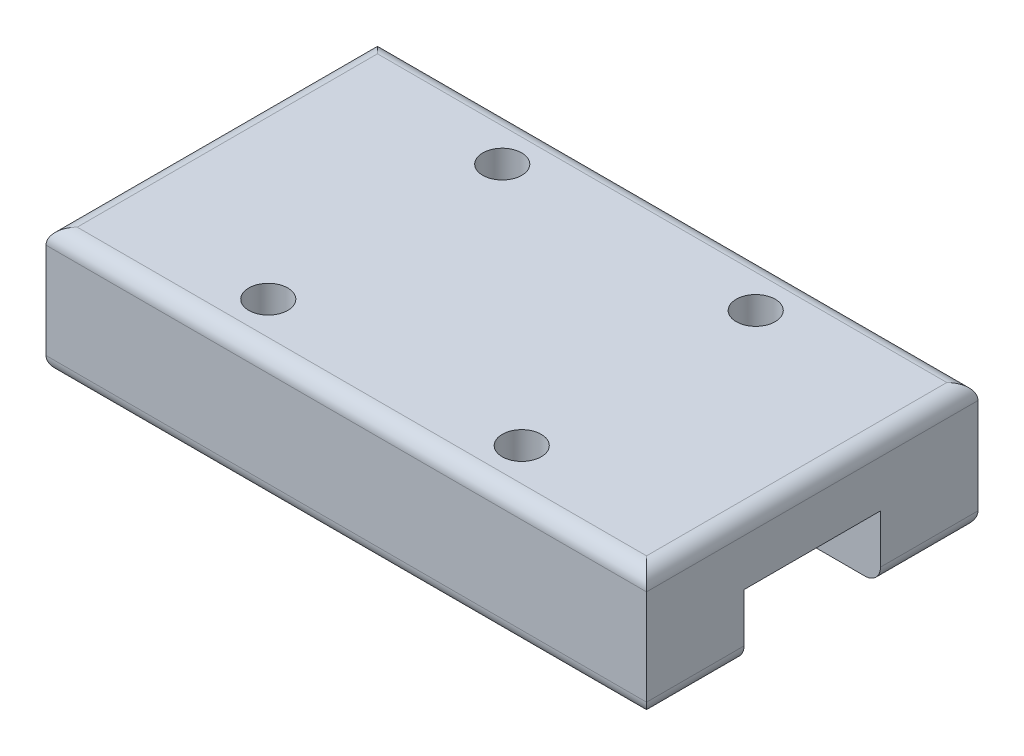
ISO-10303-21;
HEADER;
FILE_DESCRIPTION(('STEP AP214'),'2;1');
FILE_NAME('part.step','',(''),(''),'','','');
FILE_SCHEMA(('AUTOMOTIVE_DESIGN { 1 0 10303 214 1 1 1 1 }'));
ENDSEC;
DATA;
#1=APPLICATION_CONTEXT('core data for automotive mechanical design processes');
#2=APPLICATION_PROTOCOL_DEFINITION('international standard','automotive_design',2000,#1);
#3=PRODUCT_CONTEXT('',#1,'mechanical');
#4=PRODUCT('Part','Part','',(#3));
#5=PRODUCT_RELATED_PRODUCT_CATEGORY('part','',(#4));
#6=PRODUCT_DEFINITION_FORMATION('','',#4);
#7=PRODUCT_DEFINITION_CONTEXT('part definition',#1,'design');
#8=PRODUCT_DEFINITION('design','',#6,#7);
#9=PRODUCT_DEFINITION_SHAPE('','',#8);
#10=(LENGTH_UNIT() NAMED_UNIT(*) SI_UNIT(.MILLI.,.METRE.));
#11=(NAMED_UNIT(*) PLANE_ANGLE_UNIT() SI_UNIT($,.RADIAN.));
#12=(NAMED_UNIT(*) SI_UNIT($,.STERADIAN.) SOLID_ANGLE_UNIT());
#13=UNCERTAINTY_MEASURE_WITH_UNIT(LENGTH_MEASURE(1.E-05),#10,'distance_accuracy_value','');
#14=(GEOMETRIC_REPRESENTATION_CONTEXT(3) GLOBAL_UNCERTAINTY_ASSIGNED_CONTEXT((#13)) GLOBAL_UNIT_ASSIGNED_CONTEXT((#10,
#11,#12)) REPRESENTATION_CONTEXT('',''));
#15=CARTESIAN_POINT('',(0.,0.,0.));
#16=DIRECTION('',(0.,0.,1.));
#17=DIRECTION('',(1.,0.,0.));
#18=AXIS2_PLACEMENT_3D('',#15,#16,#17);
#19=CARTESIAN_POINT('',(-15.4,-3.25,8.5));
#20=DIRECTION('',(0.,1.,0.));
#21=DIRECTION('',(0.,0.,1.));
#22=AXIS2_PLACEMENT_3D('',#19,#20,#21);
#23=PLANE('',#22);
#24=DIRECTION('',(-1.,0.,0.));
#25=VECTOR('',#24,1.);
#26=CARTESIAN_POINT('',(15.401,-3.25,-3.5));
#27=LINE('',#26,#25);
#28=CARTESIAN_POINT('',(14.6,-3.25,-3.5));
#29=VERTEX_POINT('',#28);
#30=CARTESIAN_POINT('',(-14.6,-3.25,-3.5));
#31=VERTEX_POINT('',#30);
#32=EDGE_CURVE('E166',#29,#31,#27,.T.);
#33=ORIENTED_EDGE('',*,*,#32,.T.);
#34=DIRECTION('',(0.,0.,-1.));
#35=VECTOR('',#34,1.);
#36=CARTESIAN_POINT('',(-14.6,-3.25,8.5));
#37=LINE('',#36,#35);
#38=CARTESIAN_POINT('',(-14.6,-3.25,-7.7));
#39=VERTEX_POINT('',#38);
#40=EDGE_CURVE('E228',#31,#39,#37,.T.);
#41=ORIENTED_EDGE('',*,*,#40,.T.);
#42=DIRECTION('',(1.,0.,0.));
#43=VECTOR('',#42,1.);
#44=CARTESIAN_POINT('',(-15.4,-3.25,-7.7));
#45=LINE('',#44,#43);
#46=CARTESIAN_POINT('',(14.6,-3.25,-7.7));
#47=VERTEX_POINT('',#46);
#48=EDGE_CURVE('E226',#39,#47,#45,.T.);
#49=ORIENTED_EDGE('',*,*,#48,.T.);
#50=DIRECTION('',(0.,0.,-1.));
#51=VECTOR('',#50,1.);
#52=CARTESIAN_POINT('',(14.6,-3.25,8.5));
#53=LINE('',#52,#51);
#54=EDGE_CURVE('E224',#47,#29,#53,.F.);
#55=ORIENTED_EDGE('',*,*,#54,.T.);
#56=EDGE_LOOP('',(#33,#41,#49,#55));
#57=FACE_BOUND('',#56,.T.);
#58=ADVANCED_FACE('F32',(#57),#23,.F.);
#59=CARTESIAN_POINT('',(-15.4,3.25,8.5));
#60=DIRECTION('',(1.,0.,0.));
#61=DIRECTION('',(0.,0.,-1.));
#62=AXIS2_PLACEMENT_3D('',#59,#60,#61);
#63=PLANE('',#62);
#64=DIRECTION('',(0.,-1.,0.));
#65=VECTOR('',#64,1.);
#66=CARTESIAN_POINT('',(-15.4,3.25,-8.5));
#67=LINE('',#66,#65);
#68=CARTESIAN_POINT('',(-15.4,2.45,-8.5));
#69=VERTEX_POINT('',#68);
#70=CARTESIAN_POINT('',(-15.4,-2.45,-8.5));
#71=VERTEX_POINT('',#70);
#72=EDGE_CURVE('E195',#69,#71,#67,.T.);
#73=ORIENTED_EDGE('',*,*,#72,.T.);
#74=DIRECTION('',(0.,0.,-1.));
#75=VECTOR('',#74,1.);
#76=CARTESIAN_POINT('',(-15.4,-2.45,8.5));
#77=LINE('',#76,#75);
#78=CARTESIAN_POINT('',(-15.4,-2.45,-3.5));
#79=VERTEX_POINT('',#78);
#80=EDGE_CURVE('E235',#71,#79,#77,.F.);
#81=ORIENTED_EDGE('',*,*,#80,.T.);
#82=DIRECTION('',(0.,-1.,0.));
#83=VECTOR('',#82,1.);
#84=CARTESIAN_POINT('',(-15.4,-3.25,-3.5));
#85=LINE('',#84,#83);
#86=CARTESIAN_POINT('',(-15.4,0.0500000000000001,-3.5));
#87=VERTEX_POINT('',#86);
#88=EDGE_CURVE('E161',#87,#79,#85,.T.);
#89=ORIENTED_EDGE('',*,*,#88,.F.);
#90=DIRECTION('',(0.,0.,-1.));
#91=VECTOR('',#90,1.);
#92=CARTESIAN_POINT('',(-15.4,0.0500000000000001,-3.5));
#93=LINE('',#92,#91);
#94=CARTESIAN_POINT('',(-15.4,0.0500000000000001,3.5));
#95=VERTEX_POINT('',#94);
#96=EDGE_CURVE('E145',#95,#87,#93,.T.);
#97=ORIENTED_EDGE('',*,*,#96,.F.);
#98=DIRECTION('',(0.,1.,0.));
#99=VECTOR('',#98,1.);
#100=CARTESIAN_POINT('',(-15.4,0.0500000000000001,3.5));
#101=LINE('',#100,#99);
#102=CARTESIAN_POINT('',(-15.4,-2.45,3.5));
#103=VERTEX_POINT('',#102);
#104=EDGE_CURVE('E133',#103,#95,#101,.T.);
#105=ORIENTED_EDGE('',*,*,#104,.F.);
#106=DIRECTION('',(0.,0.,-1.));
#107=VECTOR('',#106,1.);
#108=CARTESIAN_POINT('',(-15.4,-2.45,8.5));
#109=LINE('',#108,#107);
#110=CARTESIAN_POINT('',(-15.4,-2.45,8.5));
#111=VERTEX_POINT('',#110);
#112=EDGE_CURVE('E233',#103,#111,#109,.F.);
#113=ORIENTED_EDGE('',*,*,#112,.T.);
#114=DIRECTION('',(0.,-1.,0.));
#115=VECTOR('',#114,1.);
#116=CARTESIAN_POINT('',(-15.4,3.25,8.5));
#117=LINE('',#116,#115);
#118=CARTESIAN_POINT('',(-15.4,2.45,8.5));
#119=VERTEX_POINT('',#118);
#120=EDGE_CURVE('E198',#119,#111,#117,.T.);
#121=ORIENTED_EDGE('',*,*,#120,.F.);
#122=DIRECTION('',(0.,0.,-1.));
#123=VECTOR('',#122,1.);
#124=CARTESIAN_POINT('',(-15.4,2.45,8.5));
#125=LINE('',#124,#123);
#126=EDGE_CURVE('E231',#119,#69,#125,.T.);
#127=ORIENTED_EDGE('',*,*,#126,.T.);
#128=EDGE_LOOP('',(#73,#81,#89,#97,#105,#113,#121,#127));
#129=FACE_BOUND('',#128,.T.);
#130=ADVANCED_FACE('F159',(#129),#63,.F.);
#131=DIRECTION('',(-1.,0.,0.));
#132=VECTOR('',#131,1.);
#133=CARTESIAN_POINT('',(15.401,-3.25,3.5));
#134=LINE('',#133,#132);
#135=CARTESIAN_POINT('',(14.6,-3.25,3.5));
#136=VERTEX_POINT('',#135);
#137=CARTESIAN_POINT('',(-14.6,-3.25,3.5));
#138=VERTEX_POINT('',#137);
#139=EDGE_CURVE('E156',#136,#138,#134,.T.);
#140=ORIENTED_EDGE('',*,*,#139,.F.);
#141=DIRECTION('',(0.,0.,-1.));
#142=VECTOR('',#141,1.);
#143=CARTESIAN_POINT('',(14.6,-3.25,8.5));
#144=LINE('',#143,#142);
#145=CARTESIAN_POINT('',(14.6,-3.25,7.7));
#146=VERTEX_POINT('',#145);
#147=EDGE_CURVE('E222',#136,#146,#144,.F.);
#148=ORIENTED_EDGE('',*,*,#147,.T.);
#149=DIRECTION('',(1.,0.,0.));
#150=VECTOR('',#149,1.);
#151=CARTESIAN_POINT('',(-15.4,-3.25,7.7));
#152=LINE('',#151,#150);
#153=CARTESIAN_POINT('',(-14.6,-3.25,7.7));
#154=VERTEX_POINT('',#153);
#155=EDGE_CURVE('E218',#146,#154,#152,.F.);
#156=ORIENTED_EDGE('',*,*,#155,.T.);
#157=DIRECTION('',(0.,0.,-1.));
#158=VECTOR('',#157,1.);
#159=CARTESIAN_POINT('',(-14.6,-3.25,8.5));
#160=LINE('',#159,#158);
#161=EDGE_CURVE('E220',#154,#138,#160,.T.);
#162=ORIENTED_EDGE('',*,*,#161,.T.);
#163=EDGE_LOOP('',(#140,#148,#156,#162));
#164=FACE_BOUND('',#163,.T.);
#165=ADVANCED_FACE('F326',(#164),#23,.F.);
#166=CARTESIAN_POINT('',(15.4,3.25,8.5));
#167=DIRECTION('',(-1.,0.,0.));
#168=DIRECTION('',(0.,0.,1.));
#169=AXIS2_PLACEMENT_3D('',#166,#167,#168);
#170=PLANE('',#169);
#171=DIRECTION('',(0.,1.,0.));
#172=VECTOR('',#171,1.);
#173=CARTESIAN_POINT('',(15.4,3.25,8.5));
#174=LINE('',#173,#172);
#175=CARTESIAN_POINT('',(15.4,-2.45,8.5));
#176=VERTEX_POINT('',#175);
#177=CARTESIAN_POINT('',(15.4,2.45,8.5));
#178=VERTEX_POINT('',#177);
#179=EDGE_CURVE('E201',#176,#178,#174,.T.);
#180=ORIENTED_EDGE('',*,*,#179,.F.);
#181=DIRECTION('',(0.,0.,-1.));
#182=VECTOR('',#181,1.);
#183=CARTESIAN_POINT('',(15.4,-2.45,8.5));
#184=LINE('',#183,#182);
#185=CARTESIAN_POINT('',(15.4,-2.45,3.5));
#186=VERTEX_POINT('',#185);
#187=EDGE_CURVE('E212',#176,#186,#184,.T.);
#188=ORIENTED_EDGE('',*,*,#187,.T.);
#189=DIRECTION('',(0.,-1.,0.));
#190=VECTOR('',#189,1.);
#191=CARTESIAN_POINT('',(15.4,0.0500000000000001,3.5));
#192=LINE('',#191,#190);
#193=CARTESIAN_POINT('',(15.4,0.0500000000000001,3.5));
#194=VERTEX_POINT('',#193);
#195=EDGE_CURVE('E169',#194,#186,#192,.T.);
#196=ORIENTED_EDGE('',*,*,#195,.F.);
#197=DIRECTION('',(0.,0.,1.));
#198=VECTOR('',#197,1.);
#199=CARTESIAN_POINT('',(15.4,0.0500000000000001,-3.5));
#200=LINE('',#199,#198);
#201=CARTESIAN_POINT('',(15.4,0.0500000000000001,-3.5));
#202=VERTEX_POINT('',#201);
#203=EDGE_CURVE('E154',#202,#194,#200,.T.);
#204=ORIENTED_EDGE('',*,*,#203,.F.);
#205=DIRECTION('',(0.,1.,0.));
#206=VECTOR('',#205,1.);
#207=CARTESIAN_POINT('',(15.4,-3.25,-3.5));
#208=LINE('',#207,#206);
#209=CARTESIAN_POINT('',(15.4,-2.45,-3.5));
#210=VERTEX_POINT('',#209);
#211=EDGE_CURVE('E146',#210,#202,#208,.T.);
#212=ORIENTED_EDGE('',*,*,#211,.F.);
#213=DIRECTION('',(0.,0.,-1.));
#214=VECTOR('',#213,1.);
#215=CARTESIAN_POINT('',(15.4,-2.45,8.5));
#216=LINE('',#215,#214);
#217=CARTESIAN_POINT('',(15.4,-2.45,-8.5));
#218=VERTEX_POINT('',#217);
#219=EDGE_CURVE('E210',#210,#218,#216,.T.);
#220=ORIENTED_EDGE('',*,*,#219,.T.);
#221=DIRECTION('',(0.,1.,0.));
#222=VECTOR('',#221,1.);
#223=CARTESIAN_POINT('',(15.4,3.25,-8.5));
#224=LINE('',#223,#222);
#225=CARTESIAN_POINT('',(15.4,2.45,-8.5));
#226=VERTEX_POINT('',#225);
#227=EDGE_CURVE('E202',#218,#226,#224,.T.);
#228=ORIENTED_EDGE('',*,*,#227,.T.);
#229=DIRECTION('',(0.,0.,-1.));
#230=VECTOR('',#229,1.);
#231=CARTESIAN_POINT('',(15.4,2.45,8.5));
#232=LINE('',#231,#230);
#233=EDGE_CURVE('E205',#226,#178,#232,.F.);
#234=ORIENTED_EDGE('',*,*,#233,.T.);
#235=EDGE_LOOP('',(#180,#188,#196,#204,#212,#220,#228,#234));
#236=FACE_BOUND('',#235,.T.);
#237=ADVANCED_FACE('F296',(#236),#170,.F.);
#238=CARTESIAN_POINT('',(-15.4,3.25,8.5));
#239=DIRECTION('',(0.,-1.,0.));
#240=DIRECTION('',(1.,0.,0.));
#241=AXIS2_PLACEMENT_3D('',#238,#239,#240);
#242=PLANE('',#241);
#243=DIRECTION('',(0.,0.,-1.));
#244=VECTOR('',#243,1.);
#245=CARTESIAN_POINT('',(14.6,3.25,8.5));
#246=LINE('',#245,#244);
#247=CARTESIAN_POINT('',(14.6,3.25,7.7));
#248=VERTEX_POINT('',#247);
#249=CARTESIAN_POINT('',(14.6,3.25,-7.7));
#250=VERTEX_POINT('',#249);
#251=EDGE_CURVE('E41',#248,#250,#246,.T.);
#252=ORIENTED_EDGE('',*,*,#251,.T.);
#253=DIRECTION('',(-1.,0.,0.));
#254=VECTOR('',#253,1.);
#255=CARTESIAN_POINT('',(-15.4,3.25,-7.7));
#256=LINE('',#255,#254);
#257=CARTESIAN_POINT('',(-14.6,3.25,-7.7));
#258=VERTEX_POINT('',#257);
#259=EDGE_CURVE('E11',#250,#258,#256,.T.);
#260=ORIENTED_EDGE('',*,*,#259,.T.);
#261=DIRECTION('',(0.,0.,-1.));
#262=VECTOR('',#261,1.);
#263=CARTESIAN_POINT('',(-14.6,3.25,8.5));
#264=LINE('',#263,#262);
#265=CARTESIAN_POINT('',(-14.6,3.25,7.7));
#266=VERTEX_POINT('',#265);
#267=EDGE_CURVE('E250',#258,#266,#264,.F.);
#268=ORIENTED_EDGE('',*,*,#267,.T.);
#269=DIRECTION('',(-1.,0.,0.));
#270=VECTOR('',#269,1.);
#271=CARTESIAN_POINT('',(15.4,3.25,7.7));
#272=LINE('',#271,#270);
#273=EDGE_CURVE('E52',#266,#248,#272,.F.);
#274=ORIENTED_EDGE('',*,*,#273,.T.);
#275=EDGE_LOOP('',(#252,#260,#268,#274));
#276=FACE_BOUND('',#275,.T.);
#277=CARTESIAN_POINT('',(6.5,3.25,6.));
#278=DIRECTION('',(0.,1.,0.));
#279=DIRECTION('',(-1.,0.,0.));
#280=AXIS2_PLACEMENT_3D('',#277,#278,#279);
#281=CIRCLE('',#280,1.);
#282=CARTESIAN_POINT('',(5.5,3.25,6.));
#283=VERTEX_POINT('',#282);
#284=EDGE_CURVE('E173',#283,#283,#281,.T.);
#285=ORIENTED_EDGE('',*,*,#284,.F.);
#286=EDGE_LOOP('',(#285));
#287=FACE_BOUND('',#286,.T.);
#288=CARTESIAN_POINT('',(6.5,3.25,-6.));
#289=DIRECTION('',(0.,1.,0.));
#290=DIRECTION('',(-1.,0.,0.));
#291=AXIS2_PLACEMENT_3D('',#288,#289,#290);
#292=CIRCLE('',#291,1.);
#293=CARTESIAN_POINT('',(5.5,3.25,-6.));
#294=VERTEX_POINT('',#293);
#295=EDGE_CURVE('E177',#294,#294,#292,.T.);
#296=ORIENTED_EDGE('',*,*,#295,.F.);
#297=EDGE_LOOP('',(#296));
#298=FACE_BOUND('',#297,.T.);
#299=CARTESIAN_POINT('',(-6.5,3.25,6.));
#300=DIRECTION('',(0.,1.,0.));
#301=DIRECTION('',(-1.,0.,0.));
#302=AXIS2_PLACEMENT_3D('',#299,#300,#301);
#303=CIRCLE('',#302,1.);
#304=CARTESIAN_POINT('',(-7.5,3.25,6.));
#305=VERTEX_POINT('',#304);
#306=EDGE_CURVE('E183',#305,#305,#303,.T.);
#307=ORIENTED_EDGE('',*,*,#306,.F.);
#308=EDGE_LOOP('',(#307));
#309=FACE_BOUND('',#308,.T.);
#310=CARTESIAN_POINT('',(-6.5,3.25,-6.));
#311=DIRECTION('',(0.,1.,0.));
#312=DIRECTION('',(-1.,0.,0.));
#313=AXIS2_PLACEMENT_3D('',#310,#311,#312);
#314=CIRCLE('',#313,1.);
#315=CARTESIAN_POINT('',(-7.5,3.25,-6.));
#316=VERTEX_POINT('',#315);
#317=EDGE_CURVE('E189',#316,#316,#314,.T.);
#318=ORIENTED_EDGE('',*,*,#317,.F.);
#319=EDGE_LOOP('',(#318));
#320=FACE_BOUND('',#319,.T.);
#321=ADVANCED_FACE('F348',(#276,#287,#298,#309,#320),#242,.F.);
#322=CARTESIAN_POINT('',(-15.4,-3.25,8.5));
#323=DIRECTION('',(0.,0.,1.));
#324=DIRECTION('',(1.,0.,0.));
#325=AXIS2_PLACEMENT_3D('',#322,#323,#324);
#326=PLANE('',#325);
#327=ORIENTED_EDGE('',*,*,#120,.T.);
#328=DIRECTION('',(1.,0.,0.));
#329=VECTOR('',#328,1.);
#330=CARTESIAN_POINT('',(15.4,-2.45,8.5));
#331=LINE('',#330,#329);
#332=EDGE_CURVE('E248',#111,#176,#331,.T.);
#333=ORIENTED_EDGE('',*,*,#332,.T.);
#334=ORIENTED_EDGE('',*,*,#179,.T.);
#335=DIRECTION('',(-1.,0.,0.));
#336=VECTOR('',#335,1.);
#337=CARTESIAN_POINT('',(-15.4,2.45,8.5));
#338=LINE('',#337,#336);
#339=EDGE_CURVE('E246',#178,#119,#338,.T.);
#340=ORIENTED_EDGE('',*,*,#339,.T.);
#341=EDGE_LOOP('',(#327,#333,#334,#340));
#342=FACE_BOUND('',#341,.T.);
#343=ADVANCED_FACE('F282',(#342),#326,.T.);
#344=CARTESIAN_POINT('',(-15.4,-3.25,-8.5));
#345=DIRECTION('',(0.,0.,1.));
#346=DIRECTION('',(1.,0.,0.));
#347=AXIS2_PLACEMENT_3D('',#344,#345,#346);
#348=PLANE('',#347);
#349=ORIENTED_EDGE('',*,*,#227,.F.);
#350=DIRECTION('',(1.,0.,0.));
#351=VECTOR('',#350,1.);
#352=CARTESIAN_POINT('',(-15.4,-2.45,-8.5));
#353=LINE('',#352,#351);
#354=EDGE_CURVE('E244',#218,#71,#353,.F.);
#355=ORIENTED_EDGE('',*,*,#354,.T.);
#356=ORIENTED_EDGE('',*,*,#72,.F.);
#357=DIRECTION('',(-1.,0.,0.));
#358=VECTOR('',#357,1.);
#359=CARTESIAN_POINT('',(-15.4,2.45,-8.5));
#360=LINE('',#359,#358);
#361=EDGE_CURVE('E241',#69,#226,#360,.F.);
#362=ORIENTED_EDGE('',*,*,#361,.T.);
#363=EDGE_LOOP('',(#349,#355,#356,#362));
#364=FACE_BOUND('',#363,.T.);
#365=ADVANCED_FACE('F302',(#364),#348,.F.);
#366=CARTESIAN_POINT('',(-6.5,0.75,-6.));
#367=DIRECTION('',(0.,1.,0.));
#368=DIRECTION('',(-1.,0.,0.));
#369=AXIS2_PLACEMENT_3D('',#366,#367,#368);
#370=CYLINDRICAL_SURFACE('',#369,1.);
#371=CARTESIAN_POINT('',(-6.5,0.75,-6.));
#372=DIRECTION('',(0.,1.,0.));
#373=DIRECTION('',(-1.,0.,0.));
#374=AXIS2_PLACEMENT_3D('',#371,#372,#373);
#375=CIRCLE('',#374,1.);
#376=CARTESIAN_POINT('',(-7.5,0.75,-6.));
#377=VERTEX_POINT('',#376);
#378=EDGE_CURVE('E192',#377,#377,#375,.T.);
#379=ORIENTED_EDGE('',*,*,#378,.F.);
#380=EDGE_LOOP('',(#379));
#381=FACE_BOUND('',#380,.T.);
#382=ORIENTED_EDGE('',*,*,#317,.T.);
#383=EDGE_LOOP('',(#382));
#384=FACE_BOUND('',#383,.T.);
#385=ADVANCED_FACE('F356',(#381,#384),#370,.F.);
#386=CARTESIAN_POINT('',(-6.5,0.75,-6.));
#387=DIRECTION('',(0.,1.,0.));
#388=DIRECTION('',(-1.,0.,0.));
#389=AXIS2_PLACEMENT_3D('',#386,#387,#388);
#390=PLANE('',#389);
#391=ORIENTED_EDGE('',*,*,#378,.T.);
#392=EDGE_LOOP('',(#391));
#393=FACE_BOUND('',#392,.T.);
#394=ADVANCED_FACE('F361',(#393),#390,.T.);
#395=CARTESIAN_POINT('',(-6.5,0.75,6.));
#396=DIRECTION('',(0.,1.,0.));
#397=DIRECTION('',(-1.,0.,0.));
#398=AXIS2_PLACEMENT_3D('',#395,#396,#397);
#399=CYLINDRICAL_SURFACE('',#398,1.);
#400=CARTESIAN_POINT('',(-6.5,0.75,6.));
#401=DIRECTION('',(0.,1.,0.));
#402=DIRECTION('',(-1.,0.,0.));
#403=AXIS2_PLACEMENT_3D('',#400,#401,#402);
#404=CIRCLE('',#403,1.);
#405=CARTESIAN_POINT('',(-7.5,0.75,6.));
#406=VERTEX_POINT('',#405);
#407=EDGE_CURVE('E186',#406,#406,#404,.T.);
#408=ORIENTED_EDGE('',*,*,#407,.F.);
#409=EDGE_LOOP('',(#408));
#410=FACE_BOUND('',#409,.T.);
#411=ORIENTED_EDGE('',*,*,#306,.T.);
#412=EDGE_LOOP('',(#411));
#413=FACE_BOUND('',#412,.T.);
#414=ADVANCED_FACE('F365',(#410,#413),#399,.F.);
#415=CARTESIAN_POINT('',(-6.5,0.75,6.));
#416=DIRECTION('',(0.,1.,0.));
#417=DIRECTION('',(-1.,0.,0.));
#418=AXIS2_PLACEMENT_3D('',#415,#416,#417);
#419=PLANE('',#418);
#420=ORIENTED_EDGE('',*,*,#407,.T.);
#421=EDGE_LOOP('',(#420));
#422=FACE_BOUND('',#421,.T.);
#423=ADVANCED_FACE('F369',(#422),#419,.T.);
#424=CARTESIAN_POINT('',(6.5,0.75,-6.));
#425=DIRECTION('',(0.,1.,0.));
#426=DIRECTION('',(-1.,0.,0.));
#427=AXIS2_PLACEMENT_3D('',#424,#425,#426);
#428=CYLINDRICAL_SURFACE('',#427,1.);
#429=CARTESIAN_POINT('',(6.5,0.75,-6.));
#430=DIRECTION('',(0.,1.,0.));
#431=DIRECTION('',(-1.,0.,0.));
#432=AXIS2_PLACEMENT_3D('',#429,#430,#431);
#433=CIRCLE('',#432,1.);
#434=CARTESIAN_POINT('',(5.5,0.75,-6.));
#435=VERTEX_POINT('',#434);
#436=EDGE_CURVE('E180',#435,#435,#433,.T.);
#437=ORIENTED_EDGE('',*,*,#436,.F.);
#438=EDGE_LOOP('',(#437));
#439=FACE_BOUND('',#438,.T.);
#440=ORIENTED_EDGE('',*,*,#295,.T.);
#441=EDGE_LOOP('',(#440));
#442=FACE_BOUND('',#441,.T.);
#443=ADVANCED_FACE('F373',(#439,#442),#428,.F.);
#444=CARTESIAN_POINT('',(6.5,0.75,-6.));
#445=DIRECTION('',(0.,1.,0.));
#446=DIRECTION('',(-1.,0.,0.));
#447=AXIS2_PLACEMENT_3D('',#444,#445,#446);
#448=PLANE('',#447);
#449=ORIENTED_EDGE('',*,*,#436,.T.);
#450=EDGE_LOOP('',(#449));
#451=FACE_BOUND('',#450,.T.);
#452=ADVANCED_FACE('F377',(#451),#448,.T.);
#453=CARTESIAN_POINT('',(6.5,0.75,6.));
#454=DIRECTION('',(0.,1.,0.));
#455=DIRECTION('',(-1.,0.,0.));
#456=AXIS2_PLACEMENT_3D('',#453,#454,#455);
#457=CYLINDRICAL_SURFACE('',#456,1.);
#458=CARTESIAN_POINT('',(6.5,0.75,6.));
#459=DIRECTION('',(0.,1.,0.));
#460=DIRECTION('',(-1.,0.,0.));
#461=AXIS2_PLACEMENT_3D('',#458,#459,#460);
#462=CIRCLE('',#461,1.);
#463=CARTESIAN_POINT('',(5.5,0.75,6.));
#464=VERTEX_POINT('',#463);
#465=EDGE_CURVE('E174',#464,#464,#462,.T.);
#466=ORIENTED_EDGE('',*,*,#465,.F.);
#467=EDGE_LOOP('',(#466));
#468=FACE_BOUND('',#467,.T.);
#469=ORIENTED_EDGE('',*,*,#284,.T.);
#470=EDGE_LOOP('',(#469));
#471=FACE_BOUND('',#470,.T.);
#472=ADVANCED_FACE('F381',(#468,#471),#457,.F.);
#473=CARTESIAN_POINT('',(6.5,0.75,6.));
#474=DIRECTION('',(0.,1.,0.));
#475=DIRECTION('',(-1.,0.,0.));
#476=AXIS2_PLACEMENT_3D('',#473,#474,#475);
#477=PLANE('',#476);
#478=ORIENTED_EDGE('',*,*,#465,.T.);
#479=EDGE_LOOP('',(#478));
#480=FACE_BOUND('',#479,.T.);
#481=ADVANCED_FACE('F385',(#480),#477,.T.);
#482=CARTESIAN_POINT('',(15.401,-3.25,-3.5));
#483=DIRECTION('',(0.,0.,-1.));
#484=DIRECTION('',(-1.,0.,0.));
#485=AXIS2_PLACEMENT_3D('',#482,#483,#484);
#486=PLANE('',#485);
#487=ORIENTED_EDGE('',*,*,#88,.T.);
#488=CARTESIAN_POINT('',(-14.6,-2.45,-3.5));
#489=DIRECTION('',(0.,0.,-1.));
#490=DIRECTION('',(-1.,0.,0.));
#491=AXIS2_PLACEMENT_3D('',#488,#489,#490);
#492=CIRCLE('',#491,0.8);
#493=EDGE_CURVE('E239',#79,#31,#492,.F.);
#494=ORIENTED_EDGE('',*,*,#493,.T.);
#495=ORIENTED_EDGE('',*,*,#32,.F.);
#496=CARTESIAN_POINT('',(14.6,-2.45,-3.5));
#497=DIRECTION('',(0.,0.,-1.));
#498=DIRECTION('',(-1.,0.,0.));
#499=AXIS2_PLACEMENT_3D('',#496,#497,#498);
#500=CIRCLE('',#499,0.8);
#501=EDGE_CURVE('E237',#29,#210,#500,.F.);
#502=ORIENTED_EDGE('',*,*,#501,.T.);
#503=ORIENTED_EDGE('',*,*,#211,.T.);
#504=DIRECTION('',(-1.,0.,0.));
#505=VECTOR('',#504,1.);
#506=CARTESIAN_POINT('',(15.401,0.0500000000000001,-3.5));
#507=LINE('',#506,#505);
#508=EDGE_CURVE('E155',#202,#87,#507,.T.);
#509=ORIENTED_EDGE('',*,*,#508,.T.);
#510=EDGE_LOOP('',(#487,#494,#495,#502,#503,#509));
#511=FACE_BOUND('',#510,.T.);
#512=ADVANCED_FACE('F319',(#511),#486,.F.);
#513=CARTESIAN_POINT('',(15.401,0.0500000000000001,-3.5));
#514=DIRECTION('',(0.,1.,0.));
#515=DIRECTION('',(0.,0.,1.));
#516=AXIS2_PLACEMENT_3D('',#513,#514,#515);
#517=PLANE('',#516);
#518=ORIENTED_EDGE('',*,*,#203,.T.);
#519=DIRECTION('',(-1.,0.,0.));
#520=VECTOR('',#519,1.);
#521=CARTESIAN_POINT('',(15.401,0.0500000000000001,3.5));
#522=LINE('',#521,#520);
#523=EDGE_CURVE('E137',#194,#95,#522,.T.);
#524=ORIENTED_EDGE('',*,*,#523,.T.);
#525=ORIENTED_EDGE('',*,*,#96,.T.);
#526=ORIENTED_EDGE('',*,*,#508,.F.);
#527=EDGE_LOOP('',(#518,#524,#525,#526));
#528=FACE_BOUND('',#527,.T.);
#529=ADVANCED_FACE('F150',(#528),#517,.F.);
#530=CARTESIAN_POINT('',(15.401,0.0500000000000001,3.5));
#531=DIRECTION('',(0.,0.,1.));
#532=DIRECTION('',(1.,0.,0.));
#533=AXIS2_PLACEMENT_3D('',#530,#531,#532);
#534=PLANE('',#533);
#535=ORIENTED_EDGE('',*,*,#195,.T.);
#536=CARTESIAN_POINT('',(14.6,-2.45,3.5));
#537=DIRECTION('',(0.,0.,1.));
#538=DIRECTION('',(1.,0.,0.));
#539=AXIS2_PLACEMENT_3D('',#536,#537,#538);
#540=CIRCLE('',#539,0.8);
#541=EDGE_CURVE('E216',#186,#136,#540,.F.);
#542=ORIENTED_EDGE('',*,*,#541,.T.);
#543=ORIENTED_EDGE('',*,*,#139,.T.);
#544=CARTESIAN_POINT('',(-14.6,-2.45,3.5));
#545=DIRECTION('',(0.,0.,1.));
#546=DIRECTION('',(1.,0.,0.));
#547=AXIS2_PLACEMENT_3D('',#544,#545,#546);
#548=CIRCLE('',#547,0.8);
#549=EDGE_CURVE('E141',#138,#103,#548,.F.);
#550=ORIENTED_EDGE('',*,*,#549,.T.);
#551=ORIENTED_EDGE('',*,*,#104,.T.);
#552=ORIENTED_EDGE('',*,*,#523,.F.);
#553=EDGE_LOOP('',(#535,#542,#543,#550,#551,#552));
#554=FACE_BOUND('',#553,.T.);
#555=ADVANCED_FACE('F136',(#554),#534,.F.);
#556=CARTESIAN_POINT('',(-14.6,-2.45,8.5));
#557=DIRECTION('',(0.,0.,-1.));
#558=DIRECTION('',(-1.,0.,0.));
#559=AXIS2_PLACEMENT_3D('',#556,#557,#558);
#560=CYLINDRICAL_SURFACE('',#559,0.8);
#561=ORIENTED_EDGE('',*,*,#549,.F.);
#562=ORIENTED_EDGE('',*,*,#161,.F.);
#563=CARTESIAN_POINT('',(-14.6,-2.45,7.7));
#564=DIRECTION('',(-0.707106781186547,0.,-0.707106781186547));
#565=DIRECTION('',(-0.707106781186547,0.,0.707106781186547));
#566=AXIS2_PLACEMENT_3D('',#563,#564,#565);
#567=ELLIPSE('',#566,1.13137084989848,0.8);
#568=EDGE_CURVE('E257',#111,#154,#567,.F.);
#569=ORIENTED_EDGE('',*,*,#568,.F.);
#570=ORIENTED_EDGE('',*,*,#112,.F.);
#571=EDGE_LOOP('',(#561,#562,#569,#570));
#572=FACE_BOUND('',#571,.T.);
#573=ADVANCED_FACE('F287',(#572),#560,.T.);
#574=CARTESIAN_POINT('',(-15.4,-2.45,7.7));
#575=DIRECTION('',(-1.,0.,0.));
#576=DIRECTION('',(0.,0.,1.));
#577=AXIS2_PLACEMENT_3D('',#574,#575,#576);
#578=CYLINDRICAL_SURFACE('',#577,0.8);
#579=ORIENTED_EDGE('',*,*,#568,.T.);
#580=ORIENTED_EDGE('',*,*,#155,.F.);
#581=CARTESIAN_POINT('',(14.6,-2.45,7.7));
#582=DIRECTION('',(-0.707106781186547,0.,0.707106781186547));
#583=DIRECTION('',(-0.707106781186547,0.,-0.707106781186547));
#584=AXIS2_PLACEMENT_3D('',#581,#582,#583);
#585=ELLIPSE('',#584,1.13137084989848,0.8);
#586=EDGE_CURVE('E254',#176,#146,#585,.F.);
#587=ORIENTED_EDGE('',*,*,#586,.F.);
#588=ORIENTED_EDGE('',*,*,#332,.F.);
#589=EDGE_LOOP('',(#579,#580,#587,#588));
#590=FACE_BOUND('',#589,.T.);
#591=ADVANCED_FACE('F293',(#590),#578,.T.);
#592=CARTESIAN_POINT('',(14.6,-2.45,8.5));
#593=DIRECTION('',(0.,0.,-1.));
#594=DIRECTION('',(-1.,0.,0.));
#595=AXIS2_PLACEMENT_3D('',#592,#593,#594);
#596=CYLINDRICAL_SURFACE('',#595,0.8);
#597=ORIENTED_EDGE('',*,*,#586,.T.);
#598=ORIENTED_EDGE('',*,*,#147,.F.);
#599=ORIENTED_EDGE('',*,*,#541,.F.);
#600=ORIENTED_EDGE('',*,*,#187,.F.);
#601=EDGE_LOOP('',(#597,#598,#599,#600));
#602=FACE_BOUND('',#601,.T.);
#603=ADVANCED_FACE('F327',(#602),#596,.T.);
#604=CARTESIAN_POINT('',(14.6,-2.45,8.5));
#605=DIRECTION('',(0.,0.,-1.));
#606=DIRECTION('',(-1.,0.,0.));
#607=AXIS2_PLACEMENT_3D('',#604,#605,#606);
#608=CYLINDRICAL_SURFACE('',#607,0.8);
#609=ORIENTED_EDGE('',*,*,#501,.F.);
#610=ORIENTED_EDGE('',*,*,#54,.F.);
#611=CARTESIAN_POINT('',(14.6,-2.45,-7.7));
#612=DIRECTION('',(-0.707106781186547,0.,-0.707106781186547));
#613=DIRECTION('',(0.707106781186547,0.,-0.707106781186547));
#614=AXIS2_PLACEMENT_3D('',#611,#612,#613);
#615=ELLIPSE('',#614,1.13137084989848,0.8);
#616=EDGE_CURVE('E258',#218,#47,#615,.T.);
#617=ORIENTED_EDGE('',*,*,#616,.F.);
#618=ORIENTED_EDGE('',*,*,#219,.F.);
#619=EDGE_LOOP('',(#609,#610,#617,#618));
#620=FACE_BOUND('',#619,.T.);
#621=ADVANCED_FACE('F308',(#620),#608,.T.);
#622=CARTESIAN_POINT('',(-15.4,-2.45,-7.7));
#623=DIRECTION('',(1.,0.,0.));
#624=DIRECTION('',(0.,0.,-1.));
#625=AXIS2_PLACEMENT_3D('',#622,#623,#624);
#626=CYLINDRICAL_SURFACE('',#625,0.8);
#627=ORIENTED_EDGE('',*,*,#616,.T.);
#628=ORIENTED_EDGE('',*,*,#48,.F.);
#629=CARTESIAN_POINT('',(-14.6,-2.45,-7.7));
#630=DIRECTION('',(0.707106781186547,0.,-0.707106781186547));
#631=DIRECTION('',(0.707106781186547,0.,0.707106781186547));
#632=AXIS2_PLACEMENT_3D('',#629,#630,#631);
#633=ELLIPSE('',#632,1.13137084989848,0.8);
#634=EDGE_CURVE('E261',#71,#39,#633,.F.);
#635=ORIENTED_EDGE('',*,*,#634,.F.);
#636=ORIENTED_EDGE('',*,*,#354,.F.);
#637=EDGE_LOOP('',(#627,#628,#635,#636));
#638=FACE_BOUND('',#637,.T.);
#639=ADVANCED_FACE('F312',(#638),#626,.T.);
#640=CARTESIAN_POINT('',(-14.6,-2.45,8.5));
#641=DIRECTION('',(0.,0.,-1.));
#642=DIRECTION('',(-1.,0.,0.));
#643=AXIS2_PLACEMENT_3D('',#640,#641,#642);
#644=CYLINDRICAL_SURFACE('',#643,0.8);
#645=ORIENTED_EDGE('',*,*,#493,.F.);
#646=ORIENTED_EDGE('',*,*,#80,.F.);
#647=ORIENTED_EDGE('',*,*,#634,.T.);
#648=ORIENTED_EDGE('',*,*,#40,.F.);
#649=EDGE_LOOP('',(#645,#646,#647,#648));
#650=FACE_BOUND('',#649,.T.);
#651=ADVANCED_FACE('F317',(#650),#644,.T.);
#652=CARTESIAN_POINT('',(-15.4,2.45,7.7));
#653=DIRECTION('',(1.,0.,0.));
#654=DIRECTION('',(0.,1.,0.));
#655=AXIS2_PLACEMENT_3D('',#652,#653,#654);
#656=CYLINDRICAL_SURFACE('',#655,0.8);
#657=CARTESIAN_POINT('',(-14.6,2.45,7.7));
#658=DIRECTION('',(-0.707106781186547,0.,-0.707106781186547));
#659=DIRECTION('',(0.707106781186547,0.,-0.707106781186547));
#660=AXIS2_PLACEMENT_3D('',#657,#658,#659);
#661=ELLIPSE('',#660,1.13137084989848,0.8);
#662=EDGE_CURVE('E268',#119,#266,#661,.T.);
#663=ORIENTED_EDGE('',*,*,#662,.F.);
#664=ORIENTED_EDGE('',*,*,#339,.F.);
#665=CARTESIAN_POINT('',(14.6,2.45,7.7));
#666=DIRECTION('',(0.707106781186547,0.,-0.707106781186547));
#667=DIRECTION('',(0.707106781186547,0.,0.707106781186547));
#668=AXIS2_PLACEMENT_3D('',#665,#666,#667);
#669=ELLIPSE('',#668,1.13137084989848,0.8);
#670=EDGE_CURVE('E36',#248,#178,#669,.T.);
#671=ORIENTED_EDGE('',*,*,#670,.F.);
#672=ORIENTED_EDGE('',*,*,#273,.F.);
#673=EDGE_LOOP('',(#663,#664,#671,#672));
#674=FACE_BOUND('',#673,.T.);
#675=ADVANCED_FACE('F34',(#674),#656,.T.);
#676=CARTESIAN_POINT('',(14.6,2.45,8.5));
#677=DIRECTION('',(0.,0.,-1.));
#678=DIRECTION('',(-1.,0.,0.));
#679=AXIS2_PLACEMENT_3D('',#676,#677,#678);
#680=CYLINDRICAL_SURFACE('',#679,0.8);
#681=ORIENTED_EDGE('',*,*,#670,.T.);
#682=ORIENTED_EDGE('',*,*,#233,.F.);
#683=CARTESIAN_POINT('',(14.6,2.45,-7.7));
#684=DIRECTION('',(-0.707106781186547,0.,-0.707106781186547));
#685=DIRECTION('',(0.707106781186547,0.,-0.707106781186547));
#686=AXIS2_PLACEMENT_3D('',#683,#684,#685);
#687=ELLIPSE('',#686,1.13137084989848,0.8);
#688=EDGE_CURVE('E267',#250,#226,#687,.T.);
#689=ORIENTED_EDGE('',*,*,#688,.F.);
#690=ORIENTED_EDGE('',*,*,#251,.F.);
#691=EDGE_LOOP('',(#681,#682,#689,#690));
#692=FACE_BOUND('',#691,.T.);
#693=ADVANCED_FACE('F277',(#692),#680,.T.);
#694=CARTESIAN_POINT('',(-14.6,2.45,8.5));
#695=DIRECTION('',(0.,0.,-1.));
#696=DIRECTION('',(-1.,0.,0.));
#697=AXIS2_PLACEMENT_3D('',#694,#695,#696);
#698=CYLINDRICAL_SURFACE('',#697,0.8);
#699=ORIENTED_EDGE('',*,*,#662,.T.);
#700=ORIENTED_EDGE('',*,*,#267,.F.);
#701=CARTESIAN_POINT('',(-14.6,2.45,-7.7));
#702=DIRECTION('',(0.707106781186547,0.,-0.707106781186547));
#703=DIRECTION('',(-0.707106781186547,0.,-0.707106781186547));
#704=AXIS2_PLACEMENT_3D('',#701,#702,#703);
#705=ELLIPSE('',#704,1.13137084989848,0.8);
#706=EDGE_CURVE('E265',#69,#258,#705,.T.);
#707=ORIENTED_EDGE('',*,*,#706,.F.);
#708=ORIENTED_EDGE('',*,*,#126,.F.);
#709=EDGE_LOOP('',(#699,#700,#707,#708));
#710=FACE_BOUND('',#709,.T.);
#711=ADVANCED_FACE('F460',(#710),#698,.T.);
#712=CARTESIAN_POINT('',(-15.4,2.45,-7.7));
#713=DIRECTION('',(-1.,0.,0.));
#714=DIRECTION('',(0.,-1.,0.));
#715=AXIS2_PLACEMENT_3D('',#712,#713,#714);
#716=CYLINDRICAL_SURFACE('',#715,0.8);
#717=ORIENTED_EDGE('',*,*,#688,.T.);
#718=ORIENTED_EDGE('',*,*,#361,.F.);
#719=ORIENTED_EDGE('',*,*,#706,.T.);
#720=ORIENTED_EDGE('',*,*,#259,.F.);
#721=EDGE_LOOP('',(#717,#718,#719,#720));
#722=FACE_BOUND('',#721,.T.);
#723=ADVANCED_FACE('F468',(#722),#716,.T.);
#724=CLOSED_SHELL('',(#58,#130,#165,#237,#321,#343,#365,#385,#394,#414,#423,#443,#452,#472,#481,
#512,#529,#555,#573,#591,#603,#621,#639,#651,#675,#693,#711,#723));
#725=MANIFOLD_SOLID_BREP('B2',#724);
#726=ADVANCED_BREP_SHAPE_REPRESENTATION('',(#18,#725),#14);
#727=SHAPE_DEFINITION_REPRESENTATION(#9,#726);
ENDSEC;
END-ISO-10303-21;
